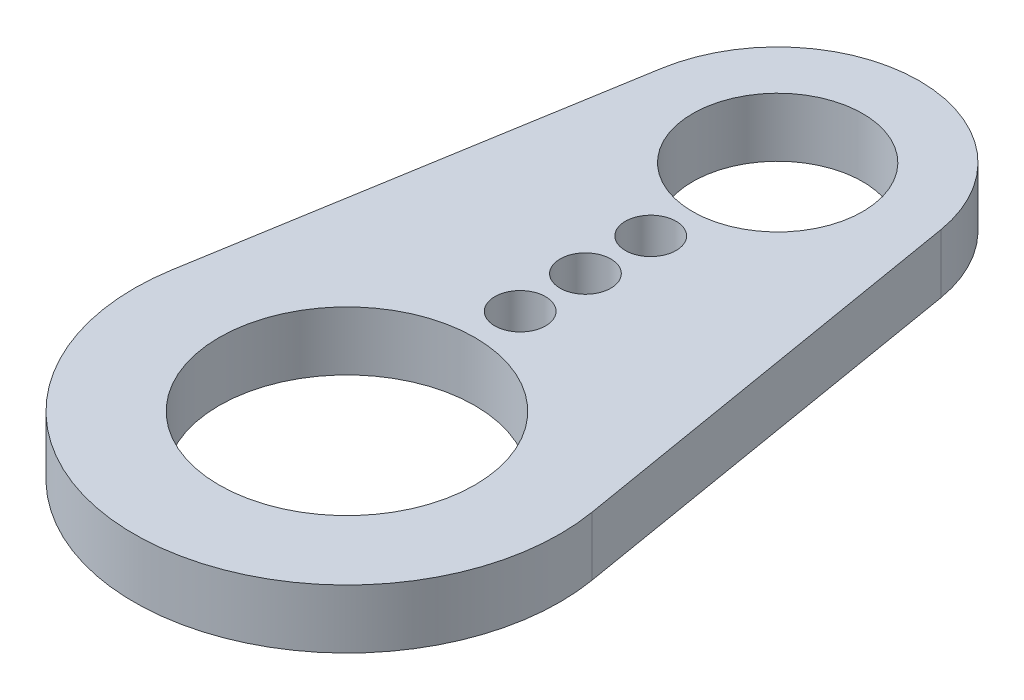
ISO-10303-21;
HEADER;
FILE_DESCRIPTION(('STEP AP214'),'2;1');
FILE_NAME('part.step','',(''),(''),'','','');
FILE_SCHEMA(('AUTOMOTIVE_DESIGN { 1 0 10303 214 1 1 1 1 }'));
ENDSEC;
DATA;
#1=APPLICATION_CONTEXT('core data for automotive mechanical design processes');
#2=APPLICATION_PROTOCOL_DEFINITION('international standard','automotive_design',2000,#1);
#3=PRODUCT_CONTEXT('',#1,'mechanical');
#4=PRODUCT('Part','Part','',(#3));
#5=PRODUCT_RELATED_PRODUCT_CATEGORY('part','',(#4));
#6=PRODUCT_DEFINITION_FORMATION('','',#4);
#7=PRODUCT_DEFINITION_CONTEXT('part definition',#1,'design');
#8=PRODUCT_DEFINITION('design','',#6,#7);
#9=PRODUCT_DEFINITION_SHAPE('','',#8);
#10=(LENGTH_UNIT() NAMED_UNIT(*) SI_UNIT(.MILLI.,.METRE.));
#11=(NAMED_UNIT(*) PLANE_ANGLE_UNIT() SI_UNIT($,.RADIAN.));
#12=(NAMED_UNIT(*) SI_UNIT($,.STERADIAN.) SOLID_ANGLE_UNIT());
#13=UNCERTAINTY_MEASURE_WITH_UNIT(LENGTH_MEASURE(1.E-05),#10,'distance_accuracy_value','');
#14=(GEOMETRIC_REPRESENTATION_CONTEXT(3) GLOBAL_UNCERTAINTY_ASSIGNED_CONTEXT((#13)) GLOBAL_UNIT_ASSIGNED_CONTEXT((#10,
#11,#12)) REPRESENTATION_CONTEXT('',''));
#15=CARTESIAN_POINT('',(0.,0.,0.));
#16=DIRECTION('',(0.,0.,1.));
#17=DIRECTION('',(1.,0.,0.));
#18=AXIS2_PLACEMENT_3D('',#15,#16,#17);
#19=CARTESIAN_POINT('',(0.,0.8255,0.));
#20=DIRECTION('',(0.,1.,0.));
#21=DIRECTION('',(0.,0.,1.));
#22=AXIS2_PLACEMENT_3D('',#19,#20,#21);
#23=PLANE('',#22);
#24=CARTESIAN_POINT('',(0.,0.8255,-8.509));
#25=DIRECTION('',(0.,1.,0.));
#26=DIRECTION('',(0.,0.,1.));
#27=AXIS2_PLACEMENT_3D('',#24,#25,#26);
#28=CIRCLE('',#27,0.7112);
#29=CARTESIAN_POINT('',(0.,0.8255,-7.7978));
#30=VERTEX_POINT('',#29);
#31=EDGE_CURVE('E124',#30,#30,#28,.T.);
#32=ORIENTED_EDGE('',*,*,#31,.F.);
#33=EDGE_LOOP('',(#32));
#34=FACE_BOUND('',#33,.T.);
#35=CARTESIAN_POINT('',(0.,0.8255,-4.8514));
#36=DIRECTION('',(0.,1.,0.));
#37=DIRECTION('',(0.,0.,1.));
#38=AXIS2_PLACEMENT_3D('',#35,#36,#37);
#39=CIRCLE('',#38,0.7112);
#40=CARTESIAN_POINT('',(0.,0.8255,-4.1402));
#41=VERTEX_POINT('',#40);
#42=EDGE_CURVE('E112',#41,#41,#39,.T.);
#43=ORIENTED_EDGE('',*,*,#42,.F.);
#44=EDGE_LOOP('',(#43));
#45=FACE_BOUND('',#44,.T.);
#46=CARTESIAN_POINT('',(0.,0.8255,0.));
#47=DIRECTION('',(0.,1.,0.));
#48=DIRECTION('',(0.,0.,1.));
#49=AXIS2_PLACEMENT_3D('',#46,#47,#48);
#50=CIRCLE('',#49,5.96265);
#51=CARTESIAN_POINT('',(-5.88066061863591,0.8255,-0.985406368421053));
#52=VERTEX_POINT('',#51);
#53=CARTESIAN_POINT('',(5.88066061863591,0.8255,-0.985406368421053));
#54=VERTEX_POINT('',#53);
#55=EDGE_CURVE('E82',#52,#54,#50,.T.);
#56=ORIENTED_EDGE('',*,*,#55,.T.);
#57=DIRECTION('',(-0.165263157894737,0.,-0.986249506282593));
#58=VECTOR('',#57,1.);
#59=CARTESIAN_POINT('',(3.91417772805904,0.8255,-12.7208881578947));
#60=LINE('',#59,#58);
#61=CARTESIAN_POINT('',(3.91417772805904,0.8255,-12.7208881578947));
#62=VERTEX_POINT('',#61);
#63=EDGE_CURVE('E77',#54,#62,#60,.T.);
#64=ORIENTED_EDGE('',*,*,#63,.T.);
#65=CARTESIAN_POINT('',(0.,0.8255,-12.065));
#66=DIRECTION('',(0.,1.,0.));
#67=DIRECTION('',(0.,0.,-1.));
#68=AXIS2_PLACEMENT_3D('',#65,#66,#67);
#69=CIRCLE('',#68,3.96875);
#70=CARTESIAN_POINT('',(-3.91417772805904,0.8255,-12.7208881578947));
#71=VERTEX_POINT('',#70);
#72=EDGE_CURVE('E80',#62,#71,#69,.T.);
#73=ORIENTED_EDGE('',*,*,#72,.T.);
#74=DIRECTION('',(-0.165263157894737,0.,0.986249506282593));
#75=VECTOR('',#74,1.);
#76=CARTESIAN_POINT('',(-3.91417772805904,0.8255,-12.7208881578947));
#77=LINE('',#76,#75);
#78=EDGE_CURVE('E47',#71,#52,#77,.T.);
#79=ORIENTED_EDGE('',*,*,#78,.T.);
#80=EDGE_LOOP('',(#56,#64,#73,#79));
#81=FACE_BOUND('',#80,.T.);
#82=CARTESIAN_POINT('',(0.,0.8255,0.));
#83=DIRECTION('',(0.,1.,0.));
#84=DIRECTION('',(0.,0.,1.));
#85=AXIS2_PLACEMENT_3D('',#82,#83,#84);
#86=CIRCLE('',#85,3.5814);
#87=CARTESIAN_POINT('',(0.,0.8255,3.5814));
#88=VERTEX_POINT('',#87);
#89=EDGE_CURVE('E97',#88,#88,#86,.T.);
#90=ORIENTED_EDGE('',*,*,#89,.F.);
#91=EDGE_LOOP('',(#90));
#92=FACE_BOUND('',#91,.T.);
#93=CARTESIAN_POINT('',(0.,0.8255,-6.6802));
#94=DIRECTION('',(0.,1.,0.));
#95=DIRECTION('',(0.,0.,1.));
#96=AXIS2_PLACEMENT_3D('',#93,#94,#95);
#97=CIRCLE('',#96,0.7112);
#98=CARTESIAN_POINT('',(0.,0.8255,-5.969));
#99=VERTEX_POINT('',#98);
#100=EDGE_CURVE('E118',#99,#99,#97,.T.);
#101=ORIENTED_EDGE('',*,*,#100,.F.);
#102=EDGE_LOOP('',(#101));
#103=FACE_BOUND('',#102,.T.);
#104=CARTESIAN_POINT('',(0.,0.8255,-12.065));
#105=DIRECTION('',(0.,1.,0.));
#106=DIRECTION('',(0.,0.,1.));
#107=AXIS2_PLACEMENT_3D('',#104,#105,#106);
#108=CIRCLE('',#107,2.38125);
#109=CARTESIAN_POINT('',(0.,0.8255,-9.68375));
#110=VERTEX_POINT('',#109);
#111=EDGE_CURVE('E130',#110,#110,#108,.T.);
#112=ORIENTED_EDGE('',*,*,#111,.F.);
#113=EDGE_LOOP('',(#112));
#114=FACE_BOUND('',#113,.T.);
#115=ADVANCED_FACE('F30',(#34,#45,#81,#92,#103,#114),#23,.T.);
#116=CARTESIAN_POINT('',(0.,-0.8255,0.));
#117=DIRECTION('',(0.,1.,0.));
#118=DIRECTION('',(0.,0.,1.));
#119=AXIS2_PLACEMENT_3D('',#116,#117,#118);
#120=PLANE('',#119);
#121=CARTESIAN_POINT('',(0.,-0.8255,-8.509));
#122=DIRECTION('',(0.,1.,0.));
#123=DIRECTION('',(0.,0.,1.));
#124=AXIS2_PLACEMENT_3D('',#121,#122,#123);
#125=CIRCLE('',#124,0.7112);
#126=CARTESIAN_POINT('',(0.,-0.8255,-7.7978));
#127=VERTEX_POINT('',#126);
#128=EDGE_CURVE('E127',#127,#127,#125,.T.);
#129=ORIENTED_EDGE('',*,*,#128,.T.);
#130=EDGE_LOOP('',(#129));
#131=FACE_BOUND('',#130,.T.);
#132=CARTESIAN_POINT('',(0.,-0.8255,-4.8514));
#133=DIRECTION('',(0.,1.,0.));
#134=DIRECTION('',(0.,0.,1.));
#135=AXIS2_PLACEMENT_3D('',#132,#133,#134);
#136=CIRCLE('',#135,0.7112);
#137=CARTESIAN_POINT('',(0.,-0.8255,-4.1402));
#138=VERTEX_POINT('',#137);
#139=EDGE_CURVE('E115',#138,#138,#136,.T.);
#140=ORIENTED_EDGE('',*,*,#139,.T.);
#141=EDGE_LOOP('',(#140));
#142=FACE_BOUND('',#141,.T.);
#143=CARTESIAN_POINT('',(0.,-0.8255,0.));
#144=DIRECTION('',(0.,1.,0.));
#145=DIRECTION('',(0.,0.,1.));
#146=AXIS2_PLACEMENT_3D('',#143,#144,#145);
#147=CIRCLE('',#146,5.96265);
#148=CARTESIAN_POINT('',(-5.88066061863591,-0.8255,-0.985406368421053));
#149=VERTEX_POINT('',#148);
#150=CARTESIAN_POINT('',(5.88066061863591,-0.8255,-0.985406368421053));
#151=VERTEX_POINT('',#150);
#152=EDGE_CURVE('E94',#149,#151,#147,.T.);
#153=ORIENTED_EDGE('',*,*,#152,.F.);
#154=DIRECTION('',(-0.165263157894737,0.,0.986249506282593));
#155=VECTOR('',#154,1.);
#156=CARTESIAN_POINT('',(-3.91417772805904,-0.8255,-12.7208881578947));
#157=LINE('',#156,#155);
#158=CARTESIAN_POINT('',(-3.91417772805904,-0.8255,-12.7208881578947));
#159=VERTEX_POINT('',#158);
#160=EDGE_CURVE('E70',#159,#149,#157,.T.);
#161=ORIENTED_EDGE('',*,*,#160,.F.);
#162=CARTESIAN_POINT('',(0.,-0.8255,-12.065));
#163=DIRECTION('',(0.,1.,0.));
#164=DIRECTION('',(0.,0.,-1.));
#165=AXIS2_PLACEMENT_3D('',#162,#163,#164);
#166=CIRCLE('',#165,3.96875);
#167=CARTESIAN_POINT('',(3.91417772805904,-0.8255,-12.7208881578947));
#168=VERTEX_POINT('',#167);
#169=EDGE_CURVE('E64',#168,#159,#166,.T.);
#170=ORIENTED_EDGE('',*,*,#169,.F.);
#171=DIRECTION('',(-0.165263157894737,0.,-0.986249506282593));
#172=VECTOR('',#171,1.);
#173=CARTESIAN_POINT('',(3.91417772805904,-0.8255,-12.7208881578947));
#174=LINE('',#173,#172);
#175=EDGE_CURVE('E86',#151,#168,#174,.T.);
#176=ORIENTED_EDGE('',*,*,#175,.F.);
#177=EDGE_LOOP('',(#153,#161,#170,#176));
#178=FACE_BOUND('',#177,.T.);
#179=CARTESIAN_POINT('',(0.,-0.8255,0.));
#180=DIRECTION('',(0.,1.,0.));
#181=DIRECTION('',(0.,0.,1.));
#182=AXIS2_PLACEMENT_3D('',#179,#180,#181);
#183=CIRCLE('',#182,3.5814);
#184=CARTESIAN_POINT('',(0.,-0.8255,3.5814));
#185=VERTEX_POINT('',#184);
#186=EDGE_CURVE('E109',#185,#185,#183,.T.);
#187=ORIENTED_EDGE('',*,*,#186,.T.);
#188=EDGE_LOOP('',(#187));
#189=FACE_BOUND('',#188,.T.);
#190=CARTESIAN_POINT('',(0.,-0.8255,-6.6802));
#191=DIRECTION('',(0.,1.,0.));
#192=DIRECTION('',(0.,0.,1.));
#193=AXIS2_PLACEMENT_3D('',#190,#191,#192);
#194=CIRCLE('',#193,0.7112);
#195=CARTESIAN_POINT('',(0.,-0.8255,-5.969));
#196=VERTEX_POINT('',#195);
#197=EDGE_CURVE('E121',#196,#196,#194,.T.);
#198=ORIENTED_EDGE('',*,*,#197,.T.);
#199=EDGE_LOOP('',(#198));
#200=FACE_BOUND('',#199,.T.);
#201=CARTESIAN_POINT('',(0.,-0.8255,-12.065));
#202=DIRECTION('',(0.,1.,0.));
#203=DIRECTION('',(0.,0.,1.));
#204=AXIS2_PLACEMENT_3D('',#201,#202,#203);
#205=CIRCLE('',#204,2.38125);
#206=CARTESIAN_POINT('',(0.,-0.8255,-9.68375));
#207=VERTEX_POINT('',#206);
#208=EDGE_CURVE('E133',#207,#207,#205,.T.);
#209=ORIENTED_EDGE('',*,*,#208,.T.);
#210=EDGE_LOOP('',(#209));
#211=FACE_BOUND('',#210,.T.);
#212=ADVANCED_FACE('F105',(#131,#142,#178,#189,#200,#211),#120,.F.);
#213=CARTESIAN_POINT('',(0.,0.8255,0.));
#214=DIRECTION('',(0.,-1.,0.));
#215=DIRECTION('',(0.,0.,-1.));
#216=AXIS2_PLACEMENT_3D('',#213,#214,#215);
#217=CYLINDRICAL_SURFACE('',#216,5.96265);
#218=ORIENTED_EDGE('',*,*,#152,.T.);
#219=DIRECTION('',(0.,-1.,0.));
#220=VECTOR('',#219,1.);
#221=CARTESIAN_POINT('',(5.88066061863591,0.8255,-0.985406368421053));
#222=LINE('',#221,#220);
#223=EDGE_CURVE('E11',#54,#151,#222,.T.);
#224=ORIENTED_EDGE('',*,*,#223,.F.);
#225=ORIENTED_EDGE('',*,*,#55,.F.);
#226=DIRECTION('',(0.,-1.,0.));
#227=VECTOR('',#226,1.);
#228=CARTESIAN_POINT('',(-5.88066061863591,0.8255,-0.985406368421053));
#229=LINE('',#228,#227);
#230=EDGE_CURVE('E90',#52,#149,#229,.T.);
#231=ORIENTED_EDGE('',*,*,#230,.T.);
#232=EDGE_LOOP('',(#218,#224,#225,#231));
#233=FACE_BOUND('',#232,.T.);
#234=ADVANCED_FACE('F32',(#233),#217,.T.);
#235=CARTESIAN_POINT('',(3.91417772805904,0.8255,-12.7208881578947));
#236=DIRECTION('',(-0.986249506282593,0.,0.165263157894737));
#237=DIRECTION('',(0.165263157894737,0.,0.986249506282594));
#238=AXIS2_PLACEMENT_3D('',#235,#236,#237);
#239=PLANE('',#238);
#240=ORIENTED_EDGE('',*,*,#175,.T.);
#241=DIRECTION('',(0.,-1.,0.));
#242=VECTOR('',#241,1.);
#243=CARTESIAN_POINT('',(3.91417772805904,0.8255,-12.7208881578947));
#244=LINE('',#243,#242);
#245=EDGE_CURVE('E39',#62,#168,#244,.T.);
#246=ORIENTED_EDGE('',*,*,#245,.F.);
#247=ORIENTED_EDGE('',*,*,#63,.F.);
#248=ORIENTED_EDGE('',*,*,#223,.T.);
#249=EDGE_LOOP('',(#240,#246,#247,#248));
#250=FACE_BOUND('',#249,.T.);
#251=ADVANCED_FACE('F85',(#250),#239,.F.);
#252=CARTESIAN_POINT('',(0.,0.8255,-12.065));
#253=DIRECTION('',(0.,-1.,0.));
#254=DIRECTION('',(0.,0.,-1.));
#255=AXIS2_PLACEMENT_3D('',#252,#253,#254);
#256=CYLINDRICAL_SURFACE('',#255,3.96875);
#257=ORIENTED_EDGE('',*,*,#169,.T.);
#258=DIRECTION('',(0.,-1.,0.));
#259=VECTOR('',#258,1.);
#260=CARTESIAN_POINT('',(-3.91417772805904,0.8255,-12.7208881578947));
#261=LINE('',#260,#259);
#262=EDGE_CURVE('E87',#71,#159,#261,.T.);
#263=ORIENTED_EDGE('',*,*,#262,.F.);
#264=ORIENTED_EDGE('',*,*,#72,.F.);
#265=ORIENTED_EDGE('',*,*,#245,.T.);
#266=EDGE_LOOP('',(#257,#263,#264,#265));
#267=FACE_BOUND('',#266,.T.);
#268=ADVANCED_FACE('F88',(#267),#256,.T.);
#269=CARTESIAN_POINT('',(-3.91417772805904,0.8255,-12.7208881578947));
#270=DIRECTION('',(0.986249506282593,0.,0.165263157894737));
#271=DIRECTION('',(0.165263157894737,0.,-0.986249506282594));
#272=AXIS2_PLACEMENT_3D('',#269,#270,#271);
#273=PLANE('',#272);
#274=ORIENTED_EDGE('',*,*,#160,.T.);
#275=ORIENTED_EDGE('',*,*,#230,.F.);
#276=ORIENTED_EDGE('',*,*,#78,.F.);
#277=ORIENTED_EDGE('',*,*,#262,.T.);
#278=EDGE_LOOP('',(#274,#275,#276,#277));
#279=FACE_BOUND('',#278,.T.);
#280=ADVANCED_FACE('F102',(#279),#273,.F.);
#281=CARTESIAN_POINT('',(0.,0.8255,0.));
#282=DIRECTION('',(0.,-1.,0.));
#283=DIRECTION('',(0.,0.,-1.));
#284=AXIS2_PLACEMENT_3D('',#281,#282,#283);
#285=CYLINDRICAL_SURFACE('',#284,3.5814);
#286=ORIENTED_EDGE('',*,*,#89,.T.);
#287=EDGE_LOOP('',(#286));
#288=FACE_BOUND('',#287,.T.);
#289=ORIENTED_EDGE('',*,*,#186,.F.);
#290=EDGE_LOOP('',(#289));
#291=FACE_BOUND('',#290,.T.);
#292=ADVANCED_FACE('F153',(#288,#291),#285,.F.);
#293=CARTESIAN_POINT('',(0.,0.8255,-4.8514));
#294=DIRECTION('',(0.,-1.,0.));
#295=DIRECTION('',(0.,0.,-1.));
#296=AXIS2_PLACEMENT_3D('',#293,#294,#295);
#297=CYLINDRICAL_SURFACE('',#296,0.7112);
#298=ORIENTED_EDGE('',*,*,#42,.T.);
#299=EDGE_LOOP('',(#298));
#300=FACE_BOUND('',#299,.T.);
#301=ORIENTED_EDGE('',*,*,#139,.F.);
#302=EDGE_LOOP('',(#301));
#303=FACE_BOUND('',#302,.T.);
#304=ADVANCED_FACE('F199',(#300,#303),#297,.F.);
#305=CARTESIAN_POINT('',(0.,0.8255,-6.6802));
#306=DIRECTION('',(0.,-1.,0.));
#307=DIRECTION('',(0.,0.,-1.));
#308=AXIS2_PLACEMENT_3D('',#305,#306,#307);
#309=CYLINDRICAL_SURFACE('',#308,0.7112);
#310=ORIENTED_EDGE('',*,*,#100,.T.);
#311=EDGE_LOOP('',(#310));
#312=FACE_BOUND('',#311,.T.);
#313=ORIENTED_EDGE('',*,*,#197,.F.);
#314=EDGE_LOOP('',(#313));
#315=FACE_BOUND('',#314,.T.);
#316=ADVANCED_FACE('F207',(#312,#315),#309,.F.);
#317=CARTESIAN_POINT('',(0.,0.8255,-8.509));
#318=DIRECTION('',(0.,-1.,0.));
#319=DIRECTION('',(0.,0.,-1.));
#320=AXIS2_PLACEMENT_3D('',#317,#318,#319);
#321=CYLINDRICAL_SURFACE('',#320,0.7112);
#322=ORIENTED_EDGE('',*,*,#31,.T.);
#323=EDGE_LOOP('',(#322));
#324=FACE_BOUND('',#323,.T.);
#325=ORIENTED_EDGE('',*,*,#128,.F.);
#326=EDGE_LOOP('',(#325));
#327=FACE_BOUND('',#326,.T.);
#328=ADVANCED_FACE('F215',(#324,#327),#321,.F.);
#329=CARTESIAN_POINT('',(0.,0.8255,-12.065));
#330=DIRECTION('',(0.,-1.,0.));
#331=DIRECTION('',(0.,0.,-1.));
#332=AXIS2_PLACEMENT_3D('',#329,#330,#331);
#333=CYLINDRICAL_SURFACE('',#332,2.38125);
#334=ORIENTED_EDGE('',*,*,#111,.T.);
#335=EDGE_LOOP('',(#334));
#336=FACE_BOUND('',#335,.T.);
#337=ORIENTED_EDGE('',*,*,#208,.F.);
#338=EDGE_LOOP('',(#337));
#339=FACE_BOUND('',#338,.T.);
#340=ADVANCED_FACE('F139',(#336,#339),#333,.F.);
#341=CLOSED_SHELL('',(#115,#212,#234,#251,#268,#280,#292,#304,#316,#328,#340));
#342=MANIFOLD_SOLID_BREP('B2',#341);
#343=ADVANCED_BREP_SHAPE_REPRESENTATION('',(#18,#342),#14);
#344=SHAPE_DEFINITION_REPRESENTATION(#9,#343);
ENDSEC;
END-ISO-10303-21;
